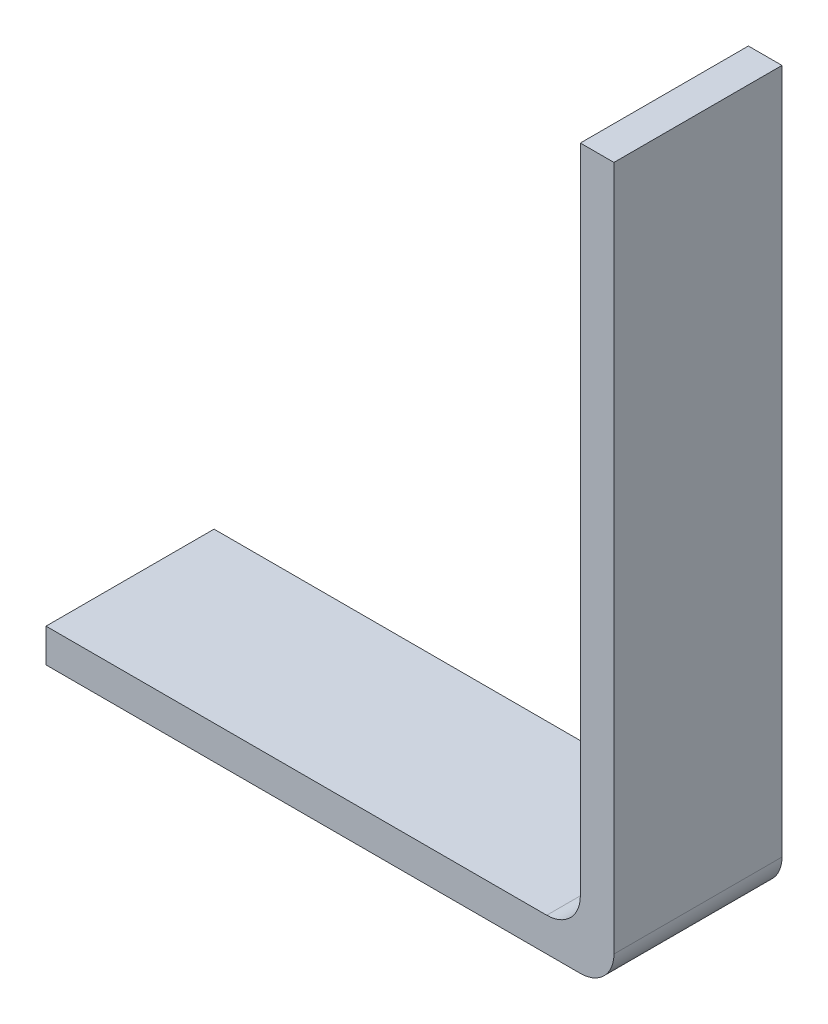
ISO-10303-21;
HEADER;
FILE_DESCRIPTION(('STEP AP214'),'2;1');
FILE_NAME('part.step','',(''),(''),'','','');
FILE_SCHEMA(('AUTOMOTIVE_DESIGN { 1 0 10303 214 1 1 1 1 }'));
ENDSEC;
DATA;
#1=APPLICATION_CONTEXT('core data for automotive mechanical design processes');
#2=APPLICATION_PROTOCOL_DEFINITION('international standard','automotive_design',2000,#1);
#3=PRODUCT_CONTEXT('',#1,'mechanical');
#4=PRODUCT('Part','Part','',(#3));
#5=PRODUCT_RELATED_PRODUCT_CATEGORY('part','',(#4));
#6=PRODUCT_DEFINITION_FORMATION('','',#4);
#7=PRODUCT_DEFINITION_CONTEXT('part definition',#1,'design');
#8=PRODUCT_DEFINITION('design','',#6,#7);
#9=PRODUCT_DEFINITION_SHAPE('','',#8);
#10=(LENGTH_UNIT() NAMED_UNIT(*) SI_UNIT(.MILLI.,.METRE.));
#11=(NAMED_UNIT(*) PLANE_ANGLE_UNIT() SI_UNIT($,.RADIAN.));
#12=(NAMED_UNIT(*) SI_UNIT($,.STERADIAN.) SOLID_ANGLE_UNIT());
#13=UNCERTAINTY_MEASURE_WITH_UNIT(LENGTH_MEASURE(1.E-05),#10,'distance_accuracy_value','');
#14=(GEOMETRIC_REPRESENTATION_CONTEXT(3) GLOBAL_UNCERTAINTY_ASSIGNED_CONTEXT((#13)) GLOBAL_UNIT_ASSIGNED_CONTEXT((#10,
#11,#12)) REPRESENTATION_CONTEXT('',''));
#15=CARTESIAN_POINT('',(0.,0.,0.));
#16=DIRECTION('',(0.,0.,1.));
#17=DIRECTION('',(1.,0.,0.));
#18=AXIS2_PLACEMENT_3D('',#15,#16,#17);
#19=CARTESIAN_POINT('',(16.9,0.,5.));
#20=DIRECTION('',(-1.,0.,0.));
#21=DIRECTION('',(0.,0.,1.));
#22=AXIS2_PLACEMENT_3D('',#19,#20,#21);
#23=PLANE('',#22);
#24=DIRECTION('',(0.,1.,0.));
#25=VECTOR('',#24,1.);
#26=CARTESIAN_POINT('',(16.9,0.,5.));
#27=LINE('',#26,#25);
#28=CARTESIAN_POINT('',(16.9,0.,5.));
#29=VERTEX_POINT('',#28);
#30=CARTESIAN_POINT('',(16.9,20.4,5.));
#31=VERTEX_POINT('',#30);
#32=EDGE_CURVE('E97',#29,#31,#27,.T.);
#33=ORIENTED_EDGE('',*,*,#32,.F.);
#34=DIRECTION('',(0.,0.,-1.));
#35=VECTOR('',#34,1.);
#36=CARTESIAN_POINT('',(16.9,0.,5.));
#37=LINE('',#36,#35);
#38=CARTESIAN_POINT('',(16.9,0.,0.));
#39=VERTEX_POINT('',#38);
#40=EDGE_CURVE('E117',#29,#39,#37,.T.);
#41=ORIENTED_EDGE('',*,*,#40,.T.);
#42=DIRECTION('',(0.,1.,0.));
#43=VECTOR('',#42,1.);
#44=CARTESIAN_POINT('',(16.9,0.,0.));
#45=LINE('',#44,#43);
#46=CARTESIAN_POINT('',(16.9,20.4,0.));
#47=VERTEX_POINT('',#46);
#48=EDGE_CURVE('E113',#39,#47,#45,.T.);
#49=ORIENTED_EDGE('',*,*,#48,.T.);
#50=DIRECTION('',(0.,0.,-1.));
#51=VECTOR('',#50,1.);
#52=CARTESIAN_POINT('',(16.9,20.4,5.));
#53=LINE('',#52,#51);
#54=EDGE_CURVE('E111',#31,#47,#53,.T.);
#55=ORIENTED_EDGE('',*,*,#54,.F.);
#56=EDGE_LOOP('',(#33,#41,#49,#55));
#57=FACE_BOUND('',#56,.T.);
#58=ADVANCED_FACE('F33',(#57),#23,.F.);
#59=CARTESIAN_POINT('',(15.9,20.4,5.));
#60=DIRECTION('',(0.,1.,0.));
#61=DIRECTION('',(0.,0.,1.));
#62=AXIS2_PLACEMENT_3D('',#59,#60,#61);
#63=PLANE('',#62);
#64=DIRECTION('',(1.,0.,0.));
#65=VECTOR('',#64,1.);
#66=CARTESIAN_POINT('',(15.9,20.4,0.));
#67=LINE('',#66,#65);
#68=CARTESIAN_POINT('',(15.9,20.4,0.));
#69=VERTEX_POINT('',#68);
#70=EDGE_CURVE('E136',#69,#47,#67,.T.);
#71=ORIENTED_EDGE('',*,*,#70,.F.);
#72=DIRECTION('',(0.,0.,-1.));
#73=VECTOR('',#72,1.);
#74=CARTESIAN_POINT('',(15.9,20.4,5.));
#75=LINE('',#74,#73);
#76=CARTESIAN_POINT('',(15.9,20.4,5.));
#77=VERTEX_POINT('',#76);
#78=EDGE_CURVE('E118',#77,#69,#75,.T.);
#79=ORIENTED_EDGE('',*,*,#78,.F.);
#80=DIRECTION('',(1.,0.,0.));
#81=VECTOR('',#80,1.);
#82=CARTESIAN_POINT('',(15.9,20.4,5.));
#83=LINE('',#82,#81);
#84=EDGE_CURVE('E102',#77,#31,#83,.T.);
#85=ORIENTED_EDGE('',*,*,#84,.T.);
#86=ORIENTED_EDGE('',*,*,#54,.T.);
#87=EDGE_LOOP('',(#71,#79,#85,#86));
#88=FACE_BOUND('',#87,.T.);
#89=ADVANCED_FACE('F121',(#88),#63,.T.);
#90=CARTESIAN_POINT('',(15.9,0.,5.));
#91=DIRECTION('',(-1.,0.,0.));
#92=DIRECTION('',(0.,0.,1.));
#93=AXIS2_PLACEMENT_3D('',#90,#91,#92);
#94=PLANE('',#93);
#95=DIRECTION('',(0.,1.,0.));
#96=VECTOR('',#95,1.);
#97=CARTESIAN_POINT('',(15.9,0.,0.));
#98=LINE('',#97,#96);
#99=CARTESIAN_POINT('',(15.9,1.,0.));
#100=VERTEX_POINT('',#99);
#101=EDGE_CURVE('E138',#100,#69,#98,.T.);
#102=ORIENTED_EDGE('',*,*,#101,.F.);
#103=DIRECTION('',(0.,0.,-1.));
#104=VECTOR('',#103,1.);
#105=CARTESIAN_POINT('',(15.9,1.,5.));
#106=LINE('',#105,#104);
#107=CARTESIAN_POINT('',(15.9,1.,5.));
#108=VERTEX_POINT('',#107);
#109=EDGE_CURVE('E54',#100,#108,#106,.F.);
#110=ORIENTED_EDGE('',*,*,#109,.T.);
#111=DIRECTION('',(0.,1.,0.));
#112=VECTOR('',#111,1.);
#113=CARTESIAN_POINT('',(15.9,0.,5.));
#114=LINE('',#113,#112);
#115=EDGE_CURVE('E123',#108,#77,#114,.T.);
#116=ORIENTED_EDGE('',*,*,#115,.T.);
#117=ORIENTED_EDGE('',*,*,#78,.T.);
#118=EDGE_LOOP('',(#102,#110,#116,#117));
#119=FACE_BOUND('',#118,.T.);
#120=ADVANCED_FACE('F166',(#119),#94,.T.);
#121=CARTESIAN_POINT('',(0.,0.,5.));
#122=DIRECTION('',(0.,1.,0.));
#123=DIRECTION('',(0.,0.,1.));
#124=AXIS2_PLACEMENT_3D('',#121,#122,#123);
#125=PLANE('',#124);
#126=DIRECTION('',(1.,0.,0.));
#127=VECTOR('',#126,1.);
#128=CARTESIAN_POINT('',(0.,0.,5.));
#129=LINE('',#128,#127);
#130=CARTESIAN_POINT('',(0.,0.,5.));
#131=VERTEX_POINT('',#130);
#132=CARTESIAN_POINT('',(14.9,0.,5.));
#133=VERTEX_POINT('',#132);
#134=EDGE_CURVE('E125',#131,#133,#129,.T.);
#135=ORIENTED_EDGE('',*,*,#134,.T.);
#136=DIRECTION('',(0.,0.,-1.));
#137=VECTOR('',#136,1.);
#138=CARTESIAN_POINT('',(14.9,0.,0.));
#139=LINE('',#138,#137);
#140=CARTESIAN_POINT('',(14.9,0.,0.));
#141=VERTEX_POINT('',#140);
#142=EDGE_CURVE('E158',#133,#141,#139,.T.);
#143=ORIENTED_EDGE('',*,*,#142,.T.);
#144=DIRECTION('',(1.,0.,0.));
#145=VECTOR('',#144,1.);
#146=CARTESIAN_POINT('',(0.,0.,0.));
#147=LINE('',#146,#145);
#148=CARTESIAN_POINT('',(0.,0.,0.));
#149=VERTEX_POINT('',#148);
#150=EDGE_CURVE('E140',#149,#141,#147,.T.);
#151=ORIENTED_EDGE('',*,*,#150,.F.);
#152=DIRECTION('',(0.,0.,-1.));
#153=VECTOR('',#152,1.);
#154=CARTESIAN_POINT('',(0.,0.,5.));
#155=LINE('',#154,#153);
#156=EDGE_CURVE('E149',#131,#149,#155,.T.);
#157=ORIENTED_EDGE('',*,*,#156,.F.);
#158=EDGE_LOOP('',(#135,#143,#151,#157));
#159=FACE_BOUND('',#158,.T.);
#160=ADVANCED_FACE('F168',(#159),#125,.T.);
#161=CARTESIAN_POINT('',(0.,-1.,5.));
#162=DIRECTION('',(-1.,0.,0.));
#163=DIRECTION('',(0.,0.,1.));
#164=AXIS2_PLACEMENT_3D('',#161,#162,#163);
#165=PLANE('',#164);
#166=DIRECTION('',(0.,1.,0.));
#167=VECTOR('',#166,1.);
#168=CARTESIAN_POINT('',(0.,-1.,0.));
#169=LINE('',#168,#167);
#170=CARTESIAN_POINT('',(0.,-1.,0.));
#171=VERTEX_POINT('',#170);
#172=EDGE_CURVE('E143',#171,#149,#169,.T.);
#173=ORIENTED_EDGE('',*,*,#172,.F.);
#174=DIRECTION('',(0.,0.,-1.));
#175=VECTOR('',#174,1.);
#176=CARTESIAN_POINT('',(0.,-1.,5.));
#177=LINE('',#176,#175);
#178=CARTESIAN_POINT('',(0.,-1.,5.));
#179=VERTEX_POINT('',#178);
#180=EDGE_CURVE('E134',#179,#171,#177,.T.);
#181=ORIENTED_EDGE('',*,*,#180,.F.);
#182=DIRECTION('',(0.,1.,0.));
#183=VECTOR('',#182,1.);
#184=CARTESIAN_POINT('',(0.,-1.,5.));
#185=LINE('',#184,#183);
#186=EDGE_CURVE('E129',#179,#131,#185,.T.);
#187=ORIENTED_EDGE('',*,*,#186,.T.);
#188=ORIENTED_EDGE('',*,*,#156,.T.);
#189=EDGE_LOOP('',(#173,#181,#187,#188));
#190=FACE_BOUND('',#189,.T.);
#191=ADVANCED_FACE('F172',(#190),#165,.T.);
#192=CARTESIAN_POINT('',(0.,-1.,5.));
#193=DIRECTION('',(0.,1.,0.));
#194=DIRECTION('',(0.,0.,1.));
#195=AXIS2_PLACEMENT_3D('',#192,#193,#194);
#196=PLANE('',#195);
#197=DIRECTION('',(1.,0.,0.));
#198=VECTOR('',#197,1.);
#199=CARTESIAN_POINT('',(0.,-1.,0.));
#200=LINE('',#199,#198);
#201=CARTESIAN_POINT('',(15.9,-1.,0.));
#202=VERTEX_POINT('',#201);
#203=EDGE_CURVE('E108',#171,#202,#200,.T.);
#204=ORIENTED_EDGE('',*,*,#203,.T.);
#205=DIRECTION('',(0.,0.,-1.));
#206=VECTOR('',#205,1.);
#207=CARTESIAN_POINT('',(15.9,-1.,5.));
#208=LINE('',#207,#206);
#209=CARTESIAN_POINT('',(15.9,-1.,5.));
#210=VERTEX_POINT('',#209);
#211=EDGE_CURVE('E155',#202,#210,#208,.F.);
#212=ORIENTED_EDGE('',*,*,#211,.T.);
#213=DIRECTION('',(1.,0.,0.));
#214=VECTOR('',#213,1.);
#215=CARTESIAN_POINT('',(0.,-1.,5.));
#216=LINE('',#215,#214);
#217=EDGE_CURVE('E132',#179,#210,#216,.T.);
#218=ORIENTED_EDGE('',*,*,#217,.F.);
#219=ORIENTED_EDGE('',*,*,#180,.T.);
#220=EDGE_LOOP('',(#204,#212,#218,#219));
#221=FACE_BOUND('',#220,.T.);
#222=ADVANCED_FACE('F176',(#221),#196,.F.);
#223=CARTESIAN_POINT('',(0.,0.,5.));
#224=DIRECTION('',(0.,0.,-1.));
#225=DIRECTION('',(-1.,0.,0.));
#226=AXIS2_PLACEMENT_3D('',#223,#224,#225);
#227=PLANE('',#226);
#228=ORIENTED_EDGE('',*,*,#217,.T.);
#229=CARTESIAN_POINT('',(15.9,0.,5.));
#230=DIRECTION('',(0.,0.,-1.));
#231=DIRECTION('',(-1.,0.,0.));
#232=AXIS2_PLACEMENT_3D('',#229,#230,#231);
#233=CIRCLE('',#232,1.);
#234=EDGE_CURVE('E104',#210,#29,#233,.F.);
#235=ORIENTED_EDGE('',*,*,#234,.T.);
#236=ORIENTED_EDGE('',*,*,#32,.T.);
#237=ORIENTED_EDGE('',*,*,#84,.F.);
#238=ORIENTED_EDGE('',*,*,#115,.F.);
#239=CARTESIAN_POINT('',(14.9,1.,5.));
#240=DIRECTION('',(0.,0.,-1.));
#241=DIRECTION('',(-1.,0.,0.));
#242=AXIS2_PLACEMENT_3D('',#239,#240,#241);
#243=CIRCLE('',#242,1.);
#244=EDGE_CURVE('E11',#108,#133,#243,.T.);
#245=ORIENTED_EDGE('',*,*,#244,.T.);
#246=ORIENTED_EDGE('',*,*,#134,.F.);
#247=ORIENTED_EDGE('',*,*,#186,.F.);
#248=EDGE_LOOP('',(#228,#235,#236,#237,#238,#245,#246,#247));
#249=FACE_BOUND('',#248,.T.);
#250=ADVANCED_FACE('F100',(#249),#227,.F.);
#251=CARTESIAN_POINT('',(0.,0.,0.));
#252=DIRECTION('',(0.,0.,-1.));
#253=DIRECTION('',(-1.,0.,0.));
#254=AXIS2_PLACEMENT_3D('',#251,#252,#253);
#255=PLANE('',#254);
#256=ORIENTED_EDGE('',*,*,#48,.F.);
#257=CARTESIAN_POINT('',(15.9,0.,0.));
#258=DIRECTION('',(0.,0.,-1.));
#259=DIRECTION('',(-1.,0.,0.));
#260=AXIS2_PLACEMENT_3D('',#257,#258,#259);
#261=CIRCLE('',#260,1.);
#262=EDGE_CURVE('E153',#39,#202,#261,.T.);
#263=ORIENTED_EDGE('',*,*,#262,.T.);
#264=ORIENTED_EDGE('',*,*,#203,.F.);
#265=ORIENTED_EDGE('',*,*,#172,.T.);
#266=ORIENTED_EDGE('',*,*,#150,.T.);
#267=CARTESIAN_POINT('',(14.9,1.,0.));
#268=DIRECTION('',(0.,0.,-1.));
#269=DIRECTION('',(-1.,0.,0.));
#270=AXIS2_PLACEMENT_3D('',#267,#268,#269);
#271=CIRCLE('',#270,1.);
#272=EDGE_CURVE('E41',#141,#100,#271,.F.);
#273=ORIENTED_EDGE('',*,*,#272,.T.);
#274=ORIENTED_EDGE('',*,*,#101,.T.);
#275=ORIENTED_EDGE('',*,*,#70,.T.);
#276=EDGE_LOOP('',(#256,#263,#264,#265,#266,#273,#274,#275));
#277=FACE_BOUND('',#276,.T.);
#278=ADVANCED_FACE('F162',(#277),#255,.T.);
#279=CARTESIAN_POINT('',(15.9,0.,5.));
#280=DIRECTION('',(0.,0.,-1.));
#281=DIRECTION('',(-1.,0.,0.));
#282=AXIS2_PLACEMENT_3D('',#279,#280,#281);
#283=CYLINDRICAL_SURFACE('',#282,1.);
#284=ORIENTED_EDGE('',*,*,#234,.F.);
#285=ORIENTED_EDGE('',*,*,#211,.F.);
#286=ORIENTED_EDGE('',*,*,#262,.F.);
#287=ORIENTED_EDGE('',*,*,#40,.F.);
#288=EDGE_LOOP('',(#284,#285,#286,#287));
#289=FACE_BOUND('',#288,.T.);
#290=ADVANCED_FACE('F179',(#289),#283,.T.);
#291=CARTESIAN_POINT('',(14.9,1.,5.));
#292=DIRECTION('',(0.,0.,1.));
#293=DIRECTION('',(1.,0.,0.));
#294=AXIS2_PLACEMENT_3D('',#291,#292,#293);
#295=CYLINDRICAL_SURFACE('',#294,1.);
#296=ORIENTED_EDGE('',*,*,#244,.F.);
#297=ORIENTED_EDGE('',*,*,#109,.F.);
#298=ORIENTED_EDGE('',*,*,#272,.F.);
#299=ORIENTED_EDGE('',*,*,#142,.F.);
#300=EDGE_LOOP('',(#296,#297,#298,#299));
#301=FACE_BOUND('',#300,.T.);
#302=ADVANCED_FACE('F35',(#301),#295,.F.);
#303=CLOSED_SHELL('',(#58,#89,#120,#160,#191,#222,#250,#278,#290,#302));
#304=MANIFOLD_SOLID_BREP('B2',#303);
#305=ADVANCED_BREP_SHAPE_REPRESENTATION('',(#18,#304),#14);
#306=SHAPE_DEFINITION_REPRESENTATION(#9,#305);
ENDSEC;
END-ISO-10303-21;
